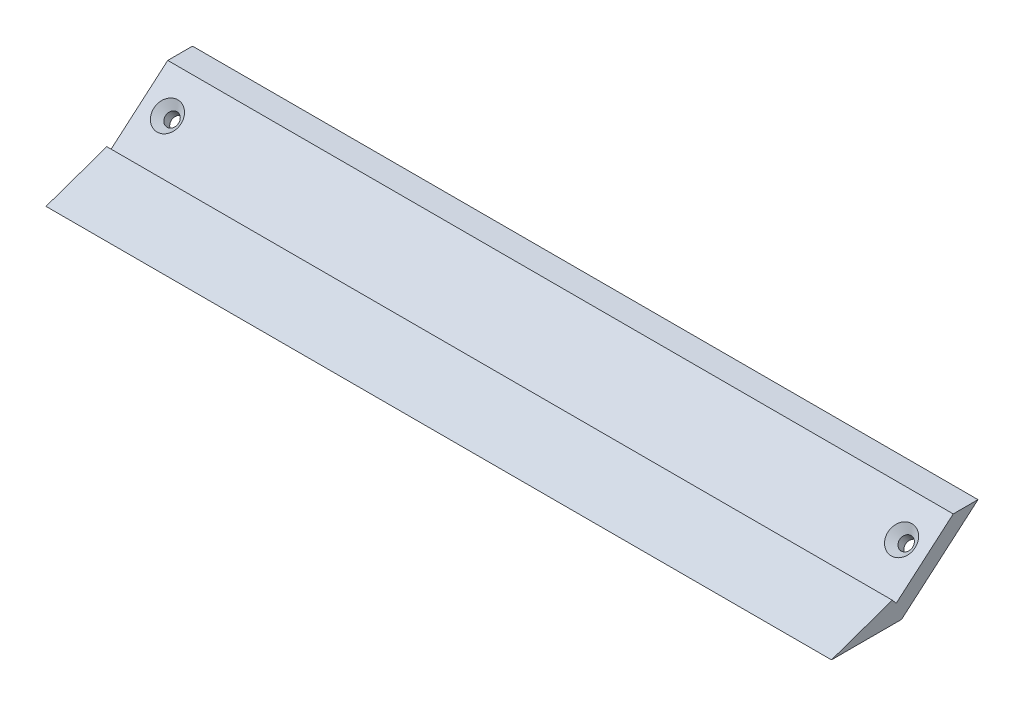
ISO-10303-21;
HEADER;
FILE_DESCRIPTION(('STEP AP214'),'2;1');
FILE_NAME('part.step','',(''),(''),'','','');
FILE_SCHEMA(('AUTOMOTIVE_DESIGN { 1 0 10303 214 1 1 1 1 }'));
ENDSEC;
DATA;
#1=APPLICATION_CONTEXT('core data for automotive mechanical design processes');
#2=APPLICATION_PROTOCOL_DEFINITION('international standard','automotive_design',2000,#1);
#3=PRODUCT_CONTEXT('',#1,'mechanical');
#4=PRODUCT('Part','Part','',(#3));
#5=PRODUCT_RELATED_PRODUCT_CATEGORY('part','',(#4));
#6=PRODUCT_DEFINITION_FORMATION('','',#4);
#7=PRODUCT_DEFINITION_CONTEXT('part definition',#1,'design');
#8=PRODUCT_DEFINITION('design','',#6,#7);
#9=PRODUCT_DEFINITION_SHAPE('','',#8);
#10=(LENGTH_UNIT() NAMED_UNIT(*) SI_UNIT(.MILLI.,.METRE.));
#11=(NAMED_UNIT(*) PLANE_ANGLE_UNIT() SI_UNIT($,.RADIAN.));
#12=(NAMED_UNIT(*) SI_UNIT($,.STERADIAN.) SOLID_ANGLE_UNIT());
#13=UNCERTAINTY_MEASURE_WITH_UNIT(LENGTH_MEASURE(1.E-05),#10,'distance_accuracy_value','');
#14=(GEOMETRIC_REPRESENTATION_CONTEXT(3) GLOBAL_UNCERTAINTY_ASSIGNED_CONTEXT((#13)) GLOBAL_UNIT_ASSIGNED_CONTEXT((#10,
#11,#12)) REPRESENTATION_CONTEXT('',''));
#15=CARTESIAN_POINT('',(0.,0.,0.));
#16=DIRECTION('',(0.,0.,1.));
#17=DIRECTION('',(1.,0.,0.));
#18=AXIS2_PLACEMENT_3D('',#15,#16,#17);
#19=CARTESIAN_POINT('',(195.,0.,72.78319995));
#20=DIRECTION('',(0.,-0.759271307334885,-0.650774217265846));
#21=DIRECTION('',(0.,0.650774217265846,-0.759271307334885));
#22=AXIS2_PLACEMENT_3D('',#19,#20,#21);
#23=PLANE('',#22);
#24=DIRECTION('',(0.,-0.650774217265846,0.759271307334885));
#25=VECTOR('',#24,1.);
#26=CARTESIAN_POINT('',(0.,0.,72.78319995));
#27=LINE('',#26,#25);
#28=CARTESIAN_POINT('',(0.,13.7693554316461,56.718217314903));
#29=VERTEX_POINT('',#28);
#30=CARTESIAN_POINT('',(0.,-2.5,75.6999999982751));
#31=VERTEX_POINT('',#30);
#32=EDGE_CURVE('E52',#29,#31,#27,.T.);
#33=ORIENTED_EDGE('',*,*,#32,.F.);
#34=DIRECTION('',(-1.,0.,0.));
#35=VECTOR('',#34,1.);
#36=CARTESIAN_POINT('',(195.,13.7693554316462,56.718217314903));
#37=LINE('',#36,#35);
#38=CARTESIAN_POINT('',(195.,13.7693554316462,56.718217314903));
#39=VERTEX_POINT('',#38);
#40=EDGE_CURVE('E143',#39,#29,#37,.T.);
#41=ORIENTED_EDGE('',*,*,#40,.F.);
#42=DIRECTION('',(0.,-0.650774217265847,0.759271307334884));
#43=VECTOR('',#42,1.);
#44=CARTESIAN_POINT('',(195.,13.7693554316462,56.718217314903));
#45=LINE('',#44,#43);
#46=CARTESIAN_POINT('',(195.,-2.5,75.6999999982751));
#47=VERTEX_POINT('',#46);
#48=EDGE_CURVE('E88',#39,#47,#45,.T.);
#49=ORIENTED_EDGE('',*,*,#48,.T.);
#50=DIRECTION('',(-1.,0.,0.));
#51=VECTOR('',#50,1.);
#52=CARTESIAN_POINT('',(195.,-2.5,75.6999999982751));
#53=LINE('',#52,#51);
#54=EDGE_CURVE('E129',#47,#31,#53,.T.);
#55=ORIENTED_EDGE('',*,*,#54,.T.);
#56=EDGE_LOOP('',(#33,#41,#49,#55));
#57=FACE_BOUND('',#56,.T.);
#58=CARTESIAN_POINT('',(188.625,5.20619373812679,66.7090294913209));
#59=DIRECTION('',(0.,0.759271307334885,0.650774217265847));
#60=DIRECTION('',(0.,-0.650774217265847,0.759271307334885));
#61=AXIS2_PLACEMENT_3D('',#58,#59,#60);
#62=CIRCLE('',#61,1.62500000000002);
#63=CARTESIAN_POINT('',(188.625,4.14868563506978,67.9428453657401));
#64=VERTEX_POINT('',#63);
#65=EDGE_CURVE('E300',#64,#64,#62,.F.);
#66=ORIENTED_EDGE('',*,*,#65,.F.);
#67=EDGE_LOOP('',(#66));
#68=FACE_BOUND('',#67,.T.);
#69=CARTESIAN_POINT('',(6.375,5.20619373812677,66.7090294913209));
#70=DIRECTION('',(0.,0.759271307334885,0.650774217265847));
#71=DIRECTION('',(0.,-0.650774217265847,0.759271307334885));
#72=AXIS2_PLACEMENT_3D('',#69,#70,#71);
#73=CIRCLE('',#72,1.62500000000002);
#74=CARTESIAN_POINT('',(6.375,4.14868563506976,67.9428453657401));
#75=VERTEX_POINT('',#74);
#76=EDGE_CURVE('E132',#75,#75,#73,.F.);
#77=ORIENTED_EDGE('',*,*,#76,.F.);
#78=EDGE_LOOP('',(#77));
#79=FACE_BOUND('',#78,.T.);
#80=ADVANCED_FACE('F36',(#57,#68,#79),#23,.T.);
#81=CARTESIAN_POINT('',(6.375,-2.38651933522207,60.2012873186625));
#82=DIRECTION('',(0.,0.759271307334884,0.650774217265847));
#83=DIRECTION('',(0.,0.650774217265847,-0.759271307334884));
#84=AXIS2_PLACEMENT_3D('',#81,#82,#83);
#85=CYLINDRICAL_SURFACE('',#84,1.62500000000002);
#86=ORIENTED_EDGE('',*,*,#76,.T.);
#87=EDGE_LOOP('',(#86));
#88=FACE_BOUND('',#87,.T.);
#89=CARTESIAN_POINT('',(6.375,6.91455417963025,68.1732714801691));
#90=DIRECTION('',(0.,0.759271307334885,0.650774217265846));
#91=DIRECTION('',(0.,-0.650774217265846,0.759271307334885));
#92=AXIS2_PLACEMENT_3D('',#89,#90,#91);
#93=CIRCLE('',#92,1.62500000000002);
#94=CARTESIAN_POINT('',(6.375,5.85704607657324,69.4070873545883));
#95=VERTEX_POINT('',#94);
#96=EDGE_CURVE('E11',#95,#95,#93,.T.);
#97=ORIENTED_EDGE('',*,*,#96,.T.);
#98=EDGE_LOOP('',(#97));
#99=FACE_BOUND('',#98,.T.);
#100=ADVANCED_FACE('F185',(#88,#99),#85,.F.);
#101=CARTESIAN_POINT('',(0.,0.,0.));
#102=DIRECTION('',(-1.,0.,0.));
#103=DIRECTION('',(0.,-1.,0.));
#104=AXIS2_PLACEMENT_3D('',#101,#102,#103);
#105=PLANE('',#104);
#106=DIRECTION('',(0.,0.,-1.));
#107=VECTOR('',#106,1.);
#108=CARTESIAN_POINT('',(0.,13.7693554316462,56.718217314903));
#109=LINE('',#108,#107);
#110=CARTESIAN_POINT('',(0.,13.7693554316462,62.8647423213877));
#111=VERTEX_POINT('',#110);
#112=EDGE_CURVE('E140',#111,#29,#109,.T.);
#113=ORIENTED_EDGE('',*,*,#112,.T.);
#114=ORIENTED_EDGE('',*,*,#32,.T.);
#115=DIRECTION('',(0.,0.,1.));
#116=VECTOR('',#115,1.);
#117=CARTESIAN_POINT('',(0.,-2.5,75.6999999982751));
#118=LINE('',#117,#116);
#119=CARTESIAN_POINT('',(0.,-2.50000000000004,93.0864007983787));
#120=VERTEX_POINT('',#119);
#121=EDGE_CURVE('E131',#31,#120,#118,.T.);
#122=ORIENTED_EDGE('',*,*,#121,.T.);
#123=DIRECTION('',(0.,0.330349663339146,-0.943858622851809));
#124=VECTOR('',#123,1.);
#125=CARTESIAN_POINT('',(0.,-2.50000000000004,93.0864007983787));
#126=LINE('',#125,#124);
#127=CARTESIAN_POINT('',(0.,2.7855946134263,77.9846628327497));
#128=VERTEX_POINT('',#127);
#129=EDGE_CURVE('E135',#120,#128,#126,.T.);
#130=ORIENTED_EDGE('',*,*,#129,.T.);
#131=DIRECTION('',(0.,-0.759271307334883,-0.650774217265848));
#132=VECTOR('',#131,1.);
#133=CARTESIAN_POINT('',(0.,2.7855946134263,77.9846628327497));
#134=LINE('',#133,#132);
#135=CARTESIAN_POINT('',(0.,1.64668765242397,77.008501506851));
#136=VERTEX_POINT('',#135);
#137=EDGE_CURVE('E102',#128,#136,#134,.T.);
#138=ORIENTED_EDGE('',*,*,#137,.T.);
#139=DIRECTION('',(0.,0.650774217265847,-0.759271307334884));
#140=VECTOR('',#139,1.);
#141=CARTESIAN_POINT('',(0.,1.64668765242397,77.008501506851));
#142=LINE('',#141,#140);
#143=EDGE_CURVE('E138',#136,#111,#142,.T.);
#144=ORIENTED_EDGE('',*,*,#143,.T.);
#145=EDGE_LOOP('',(#113,#114,#122,#130,#138,#144));
#146=FACE_BOUND('',#145,.T.);
#147=ADVANCED_FACE('F171',(#146),#105,.T.);
#148=CARTESIAN_POINT('',(195.,0.,0.));
#149=DIRECTION('',(1.,0.,0.));
#150=DIRECTION('',(0.,0.,-1.));
#151=AXIS2_PLACEMENT_3D('',#148,#149,#150);
#152=PLANE('',#151);
#153=ORIENTED_EDGE('',*,*,#48,.F.);
#154=DIRECTION('',(0.,0.,-1.));
#155=VECTOR('',#154,1.);
#156=CARTESIAN_POINT('',(195.,13.7693554316462,56.718217314903));
#157=LINE('',#156,#155);
#158=CARTESIAN_POINT('',(195.,13.7693554316462,62.8647423213877));
#159=VERTEX_POINT('',#158);
#160=EDGE_CURVE('E127',#159,#39,#157,.T.);
#161=ORIENTED_EDGE('',*,*,#160,.F.);
#162=DIRECTION('',(0.,0.650774217265847,-0.759271307334884));
#163=VECTOR('',#162,1.);
#164=CARTESIAN_POINT('',(195.,1.64668765242397,77.008501506851));
#165=LINE('',#164,#163);
#166=CARTESIAN_POINT('',(195.,1.64668765242397,77.008501506851));
#167=VERTEX_POINT('',#166);
#168=EDGE_CURVE('E118',#167,#159,#165,.T.);
#169=ORIENTED_EDGE('',*,*,#168,.F.);
#170=DIRECTION('',(0.,-0.759271307334883,-0.650774217265848));
#171=VECTOR('',#170,1.);
#172=CARTESIAN_POINT('',(195.,2.7855946134263,77.9846628327497));
#173=LINE('',#172,#171);
#174=CARTESIAN_POINT('',(195.,2.7855946134263,77.9846628327497));
#175=VERTEX_POINT('',#174);
#176=EDGE_CURVE('E100',#175,#167,#173,.T.);
#177=ORIENTED_EDGE('',*,*,#176,.F.);
#178=DIRECTION('',(0.,0.330349663339146,-0.943858622851809));
#179=VECTOR('',#178,1.);
#180=CARTESIAN_POINT('',(195.,-2.50000000000004,93.0864007983787));
#181=LINE('',#180,#179);
#182=CARTESIAN_POINT('',(195.,-2.50000000000004,93.0864007983787));
#183=VERTEX_POINT('',#182);
#184=EDGE_CURVE('E115',#183,#175,#181,.T.);
#185=ORIENTED_EDGE('',*,*,#184,.F.);
#186=DIRECTION('',(0.,0.,1.));
#187=VECTOR('',#186,1.);
#188=CARTESIAN_POINT('',(195.,-2.5,75.6999999982751));
#189=LINE('',#188,#187);
#190=EDGE_CURVE('E121',#47,#183,#189,.T.);
#191=ORIENTED_EDGE('',*,*,#190,.F.);
#192=EDGE_LOOP('',(#153,#161,#169,#177,#185,#191));
#193=FACE_BOUND('',#192,.T.);
#194=ADVANCED_FACE('F113',(#193),#152,.T.);
#195=CARTESIAN_POINT('',(195.,-2.5,75.6999999982751));
#196=DIRECTION('',(0.,-1.,0.));
#197=DIRECTION('',(0.,0.,-1.));
#198=AXIS2_PLACEMENT_3D('',#195,#196,#197);
#199=PLANE('',#198);
#200=ORIENTED_EDGE('',*,*,#121,.F.);
#201=ORIENTED_EDGE('',*,*,#54,.F.);
#202=ORIENTED_EDGE('',*,*,#190,.T.);
#203=DIRECTION('',(-1.,0.,0.));
#204=VECTOR('',#203,1.);
#205=CARTESIAN_POINT('',(195.,-2.50000000000004,93.0864007983787));
#206=LINE('',#205,#204);
#207=EDGE_CURVE('E108',#183,#120,#206,.T.);
#208=ORIENTED_EDGE('',*,*,#207,.T.);
#209=EDGE_LOOP('',(#200,#201,#202,#208));
#210=FACE_BOUND('',#209,.T.);
#211=ADVANCED_FACE('F174',(#210),#199,.T.);
#212=CARTESIAN_POINT('',(195.,-2.50000000000004,93.0864007983787));
#213=DIRECTION('',(0.,0.943858622851809,0.330349663339146));
#214=DIRECTION('',(0.,-0.330349663339146,0.943858622851809));
#215=AXIS2_PLACEMENT_3D('',#212,#213,#214);
#216=PLANE('',#215);
#217=ORIENTED_EDGE('',*,*,#129,.F.);
#218=ORIENTED_EDGE('',*,*,#207,.F.);
#219=ORIENTED_EDGE('',*,*,#184,.T.);
#220=DIRECTION('',(-1.,0.,0.));
#221=VECTOR('',#220,1.);
#222=CARTESIAN_POINT('',(195.,2.7855946134263,77.9846628327497));
#223=LINE('',#222,#221);
#224=EDGE_CURVE('E97',#175,#128,#223,.T.);
#225=ORIENTED_EDGE('',*,*,#224,.T.);
#226=EDGE_LOOP('',(#217,#218,#219,#225));
#227=FACE_BOUND('',#226,.T.);
#228=ADVANCED_FACE('F120',(#227),#216,.T.);
#229=CARTESIAN_POINT('',(195.,2.7855946134263,77.9846628327497));
#230=DIRECTION('',(0.,0.650774217265848,-0.759271307334883));
#231=DIRECTION('',(0.,0.759271307334883,0.650774217265848));
#232=AXIS2_PLACEMENT_3D('',#229,#230,#231);
#233=PLANE('',#232);
#234=ORIENTED_EDGE('',*,*,#137,.F.);
#235=ORIENTED_EDGE('',*,*,#224,.F.);
#236=ORIENTED_EDGE('',*,*,#176,.T.);
#237=DIRECTION('',(-1.,0.,0.));
#238=VECTOR('',#237,1.);
#239=CARTESIAN_POINT('',(195.,1.64668765242397,77.008501506851));
#240=LINE('',#239,#238);
#241=EDGE_CURVE('E107',#167,#136,#240,.T.);
#242=ORIENTED_EDGE('',*,*,#241,.T.);
#243=EDGE_LOOP('',(#234,#235,#236,#242));
#244=FACE_BOUND('',#243,.T.);
#245=ADVANCED_FACE('F99',(#244),#233,.T.);
#246=CARTESIAN_POINT('',(195.,1.64668765242397,77.008501506851));
#247=DIRECTION('',(0.,0.759271307334884,0.650774217265847));
#248=DIRECTION('',(0.,-0.650774217265847,0.759271307334885));
#249=AXIS2_PLACEMENT_3D('',#246,#247,#248);
#250=PLANE('',#249);
#251=CARTESIAN_POINT('',(188.625,8.24327896746633,69.3121263603843));
#252=DIRECTION('',(0.,0.759271307334884,0.650774217265847));
#253=DIRECTION('',(0.,-0.650774217265847,0.759271307334885));
#254=AXIS2_PLACEMENT_3D('',#251,#252,#253);
#255=CIRCLE('',#254,3.37499999999997);
#256=CARTESIAN_POINT('',(188.625,6.04691598419411,71.8746670226395));
#257=VERTEX_POINT('',#256);
#258=EDGE_CURVE('E152',#257,#257,#255,.F.);
#259=ORIENTED_EDGE('',*,*,#258,.T.);
#260=EDGE_LOOP('',(#259));
#261=FACE_BOUND('',#260,.T.);
#262=CARTESIAN_POINT('',(6.375,8.24327896746631,69.3121263603843));
#263=DIRECTION('',(0.,0.759271307334884,0.650774217265847));
#264=DIRECTION('',(0.,-0.650774217265847,0.759271307334885));
#265=AXIS2_PLACEMENT_3D('',#262,#263,#264);
#266=CIRCLE('',#265,3.37500000000002);
#267=CARTESIAN_POINT('',(6.375,6.04691598419406,71.8746670226396));
#268=VERTEX_POINT('',#267);
#269=EDGE_CURVE('E145',#268,#268,#266,.F.);
#270=ORIENTED_EDGE('',*,*,#269,.T.);
#271=EDGE_LOOP('',(#270));
#272=FACE_BOUND('',#271,.T.);
#273=ORIENTED_EDGE('',*,*,#143,.F.);
#274=ORIENTED_EDGE('',*,*,#241,.F.);
#275=ORIENTED_EDGE('',*,*,#168,.T.);
#276=DIRECTION('',(-1.,0.,0.));
#277=VECTOR('',#276,1.);
#278=CARTESIAN_POINT('',(195.,13.7693554316462,62.8647423213877));
#279=LINE('',#278,#277);
#280=EDGE_CURVE('E61',#159,#111,#279,.T.);
#281=ORIENTED_EDGE('',*,*,#280,.T.);
#282=EDGE_LOOP('',(#273,#274,#275,#281));
#283=FACE_BOUND('',#282,.T.);
#284=ADVANCED_FACE('F164',(#261,#272,#283),#250,.T.);
#285=CARTESIAN_POINT('',(195.,13.7693554316462,56.718217314903));
#286=DIRECTION('',(0.,1.,0.));
#287=DIRECTION('',(0.,0.,1.));
#288=AXIS2_PLACEMENT_3D('',#285,#286,#287);
#289=PLANE('',#288);
#290=ORIENTED_EDGE('',*,*,#112,.F.);
#291=ORIENTED_EDGE('',*,*,#280,.F.);
#292=ORIENTED_EDGE('',*,*,#160,.T.);
#293=ORIENTED_EDGE('',*,*,#40,.T.);
#294=EDGE_LOOP('',(#290,#291,#292,#293));
#295=FACE_BOUND('',#294,.T.);
#296=ADVANCED_FACE('F167',(#295),#289,.T.);
#297=CARTESIAN_POINT('',(188.625,-2.38651933522205,60.2012873186624));
#298=DIRECTION('',(0.,0.759271307334884,0.650774217265847));
#299=DIRECTION('',(0.,0.650774217265847,-0.759271307334884));
#300=AXIS2_PLACEMENT_3D('',#297,#298,#299);
#301=CYLINDRICAL_SURFACE('',#300,1.62500000000002);
#302=ORIENTED_EDGE('',*,*,#65,.T.);
#303=EDGE_LOOP('',(#302));
#304=FACE_BOUND('',#303,.T.);
#305=CARTESIAN_POINT('',(188.625,6.91455417963029,68.1732714801691));
#306=DIRECTION('',(0.,0.759271307334884,0.650774217265847));
#307=DIRECTION('',(0.,-0.650774217265847,0.759271307334884));
#308=AXIS2_PLACEMENT_3D('',#305,#306,#307);
#309=CIRCLE('',#308,1.62500000000002);
#310=CARTESIAN_POINT('',(188.625,5.85704607657327,69.4070873545883));
#311=VERTEX_POINT('',#310);
#312=EDGE_CURVE('E45',#311,#311,#309,.T.);
#313=ORIENTED_EDGE('',*,*,#312,.T.);
#314=EDGE_LOOP('',(#313));
#315=FACE_BOUND('',#314,.T.);
#316=ADVANCED_FACE('F157',(#304,#315),#301,.F.);
#317=CARTESIAN_POINT('',(188.625,8.24327896746633,69.3121263603843));
#318=DIRECTION('',(0.,0.759271307334884,0.650774217265847));
#319=DIRECTION('',(0.,-0.650774217265847,0.759271307334884));
#320=AXIS2_PLACEMENT_3D('',#317,#318,#319);
#321=CONICAL_SURFACE('',#320,3.37499999999998,0.785398163397439);
#322=ORIENTED_EDGE('',*,*,#312,.F.);
#323=EDGE_LOOP('',(#322));
#324=FACE_BOUND('',#323,.T.);
#325=ORIENTED_EDGE('',*,*,#258,.F.);
#326=EDGE_LOOP('',(#325));
#327=FACE_BOUND('',#326,.T.);
#328=ADVANCED_FACE('F159',(#324,#327),#321,.F.);
#329=CARTESIAN_POINT('',(6.375,8.24327896746631,69.3121263603843));
#330=DIRECTION('',(0.,0.759271307334885,0.650774217265846));
#331=DIRECTION('',(0.,-0.650774217265846,0.759271307334885));
#332=AXIS2_PLACEMENT_3D('',#329,#330,#331);
#333=CONICAL_SURFACE('',#332,3.37500000000003,0.785398163397446);
#334=ORIENTED_EDGE('',*,*,#96,.F.);
#335=EDGE_LOOP('',(#334));
#336=FACE_BOUND('',#335,.T.);
#337=ORIENTED_EDGE('',*,*,#269,.F.);
#338=EDGE_LOOP('',(#337));
#339=FACE_BOUND('',#338,.T.);
#340=ADVANCED_FACE('F39',(#336,#339),#333,.F.);
#341=CLOSED_SHELL('',(#80,#100,#147,#194,#211,#228,#245,#284,#296,#316,#328,#340));
#342=MANIFOLD_SOLID_BREP('B2',#341);
#343=ADVANCED_BREP_SHAPE_REPRESENTATION('',(#18,#342),#14);
#344=SHAPE_DEFINITION_REPRESENTATION(#9,#343);
ENDSEC;
END-ISO-10303-21;
